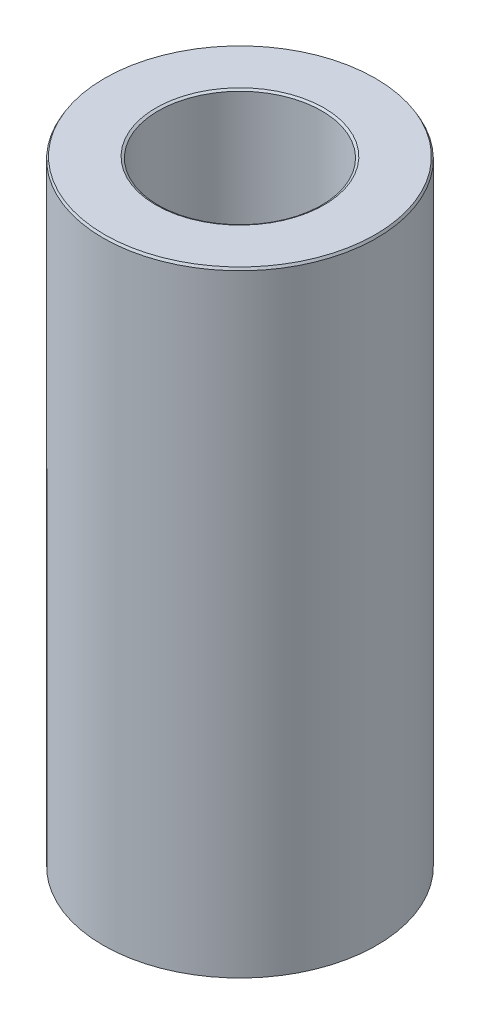
ISO-10303-21;
HEADER;
FILE_DESCRIPTION(('STEP AP214'),'2;1');
FILE_NAME('part.step','',(''),(''),'','','');
FILE_SCHEMA(('AUTOMOTIVE_DESIGN { 1 0 10303 214 1 1 1 1 }'));
ENDSEC;
DATA;
#1=APPLICATION_CONTEXT('core data for automotive mechanical design processes');
#2=APPLICATION_PROTOCOL_DEFINITION('international standard','automotive_design',2000,#1);
#3=PRODUCT_CONTEXT('',#1,'mechanical');
#4=PRODUCT('Part','Part','',(#3));
#5=PRODUCT_RELATED_PRODUCT_CATEGORY('part','',(#4));
#6=PRODUCT_DEFINITION_FORMATION('','',#4);
#7=PRODUCT_DEFINITION_CONTEXT('part definition',#1,'design');
#8=PRODUCT_DEFINITION('design','',#6,#7);
#9=PRODUCT_DEFINITION_SHAPE('','',#8);
#10=(LENGTH_UNIT() NAMED_UNIT(*) SI_UNIT(.MILLI.,.METRE.));
#11=(NAMED_UNIT(*) PLANE_ANGLE_UNIT() SI_UNIT($,.RADIAN.));
#12=(NAMED_UNIT(*) SI_UNIT($,.STERADIAN.) SOLID_ANGLE_UNIT());
#13=UNCERTAINTY_MEASURE_WITH_UNIT(LENGTH_MEASURE(1.E-05),#10,'distance_accuracy_value','');
#14=(GEOMETRIC_REPRESENTATION_CONTEXT(3) GLOBAL_UNCERTAINTY_ASSIGNED_CONTEXT((#13)) GLOBAL_UNIT_ASSIGNED_CONTEXT((#10,
#11,#12)) REPRESENTATION_CONTEXT('',''));
#15=CARTESIAN_POINT('',(0.,0.,0.));
#16=DIRECTION('',(0.,0.,1.));
#17=DIRECTION('',(1.,0.,0.));
#18=AXIS2_PLACEMENT_3D('',#15,#16,#17);
#19=CARTESIAN_POINT('',(0.,259.087044068019,0.));
#20=DIRECTION('',(0.,-1.,0.));
#21=DIRECTION('',(0.,0.,-1.));
#22=AXIS2_PLACEMENT_3D('',#19,#20,#21);
#23=CYLINDRICAL_SURFACE('',#22,57.5);
#24=CARTESIAN_POINT('',(0.,0.567233536713008,0.));
#25=DIRECTION('',(0.,1.,0.));
#26=DIRECTION('',(0.,0.,1.));
#27=AXIS2_PLACEMENT_3D('',#24,#25,#26);
#28=CIRCLE('',#27,57.5);
#29=CARTESIAN_POINT('',(0.,0.567233536713008,57.5));
#30=VERTEX_POINT('',#29);
#31=EDGE_CURVE('E10',#30,#30,#28,.T.);
#32=ORIENTED_EDGE('',*,*,#31,.T.);
#33=EDGE_LOOP('',(#32));
#34=FACE_BOUND('',#33,.T.);
#35=CARTESIAN_POINT('',(0.,258.104566762675,0.));
#36=DIRECTION('',(0.,1.,0.));
#37=DIRECTION('',(0.,0.,1.));
#38=AXIS2_PLACEMENT_3D('',#35,#36,#37);
#39=CIRCLE('',#38,57.5);
#40=CARTESIAN_POINT('',(0.,258.104566762675,57.5));
#41=VERTEX_POINT('',#40);
#42=EDGE_CURVE('E50',#41,#41,#39,.F.);
#43=ORIENTED_EDGE('',*,*,#42,.T.);
#44=EDGE_LOOP('',(#43));
#45=FACE_BOUND('',#44,.T.);
#46=ADVANCED_FACE('F39',(#34,#45),#23,.T.);
#47=CARTESIAN_POINT('',(0.,259.087044068019,0.));
#48=DIRECTION('',(0.,1.,0.));
#49=DIRECTION('',(0.,0.,1.));
#50=AXIS2_PLACEMENT_3D('',#47,#48,#49);
#51=PLANE('',#50);
#52=CARTESIAN_POINT('',(0.,259.087044068019,0.));
#53=DIRECTION('',(0.,1.,0.));
#54=DIRECTION('',(0.,0.,1.));
#55=AXIS2_PLACEMENT_3D('',#52,#53,#54);
#56=CIRCLE('',#55,35.3583827305448);
#57=CARTESIAN_POINT('',(0.,259.087044068019,35.3583827305448));
#58=VERTEX_POINT('',#57);
#59=EDGE_CURVE('E58',#58,#58,#56,.F.);
#60=ORIENTED_EDGE('',*,*,#59,.T.);
#61=EDGE_LOOP('',(#60));
#62=FACE_BOUND('',#61,.T.);
#63=CARTESIAN_POINT('',(0.,259.087044068019,0.));
#64=DIRECTION('',(0.,1.,0.));
#65=DIRECTION('',(0.,0.,1.));
#66=AXIS2_PLACEMENT_3D('',#63,#64,#65);
#67=CIRCLE('',#66,56.9327664632869);
#68=CARTESIAN_POINT('',(0.,259.087044068019,56.9327664632869));
#69=VERTEX_POINT('',#68);
#70=EDGE_CURVE('E61',#69,#69,#67,.T.);
#71=ORIENTED_EDGE('',*,*,#70,.T.);
#72=EDGE_LOOP('',(#71));
#73=FACE_BOUND('',#72,.T.);
#74=ADVANCED_FACE('F88',(#62,#73),#51,.T.);
#75=CARTESIAN_POINT('',(0.,0.,0.));
#76=DIRECTION('',(0.,1.,0.));
#77=DIRECTION('',(0.,0.,1.));
#78=AXIS2_PLACEMENT_3D('',#75,#76,#77);
#79=PLANE('',#78);
#80=CARTESIAN_POINT('',(0.,0.,0.));
#81=DIRECTION('',(0.,1.,0.));
#82=DIRECTION('',(0.,0.,1.));
#83=AXIS2_PLACEMENT_3D('',#80,#81,#82);
#84=CIRCLE('',#83,34.9431389619139);
#85=CARTESIAN_POINT('',(0.,0.,34.9431389619139));
#86=VERTEX_POINT('',#85);
#87=EDGE_CURVE('E51',#86,#86,#84,.T.);
#88=ORIENTED_EDGE('',*,*,#87,.T.);
#89=EDGE_LOOP('',(#88));
#90=FACE_BOUND('',#89,.T.);
#91=CARTESIAN_POINT('',(0.,0.,0.));
#92=DIRECTION('',(0.,1.,0.));
#93=DIRECTION('',(0.,0.,1.));
#94=AXIS2_PLACEMENT_3D('',#91,#92,#93);
#95=CIRCLE('',#94,56.5175226946561);
#96=CARTESIAN_POINT('',(0.,0.,56.5175226946561));
#97=VERTEX_POINT('',#96);
#98=EDGE_CURVE('E54',#97,#97,#95,.F.);
#99=ORIENTED_EDGE('',*,*,#98,.T.);
#100=EDGE_LOOP('',(#99));
#101=FACE_BOUND('',#100,.T.);
#102=ADVANCED_FACE('F83',(#90,#101),#79,.F.);
#103=CARTESIAN_POINT('',(0.,259.087044068019,0.));
#104=DIRECTION('',(0.,-1.,0.));
#105=DIRECTION('',(0.,0.,-1.));
#106=AXIS2_PLACEMENT_3D('',#103,#104,#105);
#107=CYLINDRICAL_SURFACE('',#106,34.3759054252008);
#108=CARTESIAN_POINT('',(0.,258.519810531306,0.));
#109=DIRECTION('',(0.,1.,0.));
#110=DIRECTION('',(0.,0.,1.));
#111=AXIS2_PLACEMENT_3D('',#108,#109,#110);
#112=CIRCLE('',#111,34.3759054252008);
#113=CARTESIAN_POINT('',(0.,258.519810531306,34.3759054252008));
#114=VERTEX_POINT('',#113);
#115=EDGE_CURVE('E67',#114,#114,#112,.T.);
#116=ORIENTED_EDGE('',*,*,#115,.T.);
#117=EDGE_LOOP('',(#116));
#118=FACE_BOUND('',#117,.T.);
#119=CARTESIAN_POINT('',(0.,0.982477305344009,0.));
#120=DIRECTION('',(0.,1.,0.));
#121=DIRECTION('',(0.,0.,1.));
#122=AXIS2_PLACEMENT_3D('',#119,#120,#121);
#123=CIRCLE('',#122,34.3759054252008);
#124=CARTESIAN_POINT('',(0.,0.982477305344009,34.3759054252008));
#125=VERTEX_POINT('',#124);
#126=EDGE_CURVE('E69',#125,#125,#123,.F.);
#127=ORIENTED_EDGE('',*,*,#126,.T.);
#128=EDGE_LOOP('',(#127));
#129=FACE_BOUND('',#128,.T.);
#130=ADVANCED_FACE('F71',(#118,#129),#107,.F.);
#131=CARTESIAN_POINT('',(0.,258.519810531306,0.));
#132=DIRECTION('',(0.,1.,0.));
#133=DIRECTION('',(0.,0.,1.));
#134=AXIS2_PLACEMENT_3D('',#131,#132,#133);
#135=CONICAL_SURFACE('',#134,34.3759054252008,1.04719755119658);
#136=ORIENTED_EDGE('',*,*,#59,.F.);
#137=EDGE_LOOP('',(#136));
#138=FACE_BOUND('',#137,.T.);
#139=ORIENTED_EDGE('',*,*,#115,.F.);
#140=EDGE_LOOP('',(#139));
#141=FACE_BOUND('',#140,.T.);
#142=ADVANCED_FACE('F77',(#138,#141),#135,.F.);
#143=CARTESIAN_POINT('',(0.,0.,0.));
#144=DIRECTION('',(0.,-1.,0.));
#145=DIRECTION('',(0.,0.,-1.));
#146=AXIS2_PLACEMENT_3D('',#143,#144,#145);
#147=CONICAL_SURFACE('',#146,34.9431389619139,0.523598775598294);
#148=ORIENTED_EDGE('',*,*,#126,.F.);
#149=EDGE_LOOP('',(#148));
#150=FACE_BOUND('',#149,.T.);
#151=ORIENTED_EDGE('',*,*,#87,.F.);
#152=EDGE_LOOP('',(#151));
#153=FACE_BOUND('',#152,.T.);
#154=ADVANCED_FACE('F73',(#150,#153),#147,.F.);
#155=CARTESIAN_POINT('',(0.,0.567233536713008,0.));
#156=DIRECTION('',(0.,1.,0.));
#157=DIRECTION('',(0.,0.,1.));
#158=AXIS2_PLACEMENT_3D('',#155,#156,#157);
#159=CONICAL_SURFACE('',#158,57.5,1.0471975511966);
#160=ORIENTED_EDGE('',*,*,#98,.F.);
#161=EDGE_LOOP('',(#160));
#162=FACE_BOUND('',#161,.T.);
#163=ORIENTED_EDGE('',*,*,#31,.F.);
#164=EDGE_LOOP('',(#163));
#165=FACE_BOUND('',#164,.T.);
#166=ADVANCED_FACE('F76',(#162,#165),#159,.T.);
#167=CARTESIAN_POINT('',(0.,259.087044068019,0.));
#168=DIRECTION('',(0.,-1.,0.));
#169=DIRECTION('',(0.,0.,-1.));
#170=AXIS2_PLACEMENT_3D('',#167,#168,#169);
#171=CONICAL_SURFACE('',#170,56.9327664632869,0.523598775598281);
#172=ORIENTED_EDGE('',*,*,#42,.F.);
#173=EDGE_LOOP('',(#172));
#174=FACE_BOUND('',#173,.T.);
#175=ORIENTED_EDGE('',*,*,#70,.F.);
#176=EDGE_LOOP('',(#175));
#177=FACE_BOUND('',#176,.T.);
#178=ADVANCED_FACE('F45',(#174,#177),#171,.T.);
#179=CLOSED_SHELL('',(#46,#74,#102,#130,#142,#154,#166,#178));
#180=MANIFOLD_SOLID_BREP('B2',#179);
#181=ADVANCED_BREP_SHAPE_REPRESENTATION('',(#18,#180),#14);
#182=SHAPE_DEFINITION_REPRESENTATION(#9,#181);
ENDSEC;
END-ISO-10303-21;
